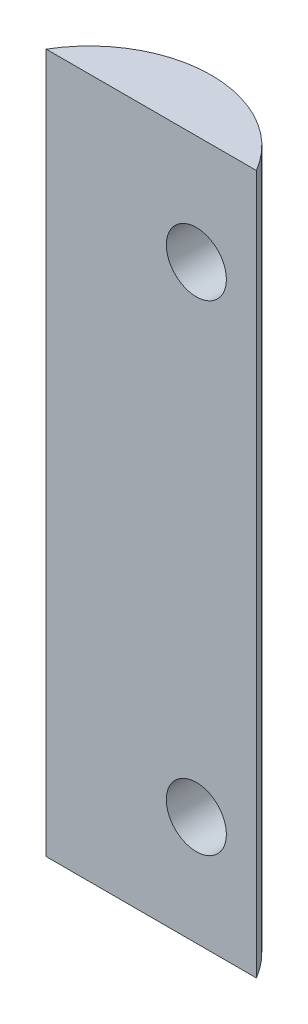
ISO-10303-21;
HEADER;
FILE_DESCRIPTION(('STEP AP214'),'2;1');
FILE_NAME('part.step','',(''),(''),'','','');
FILE_SCHEMA(('AUTOMOTIVE_DESIGN { 1 0 10303 214 1 1 1 1 }'));
ENDSEC;
DATA;
#1=APPLICATION_CONTEXT('core data for automotive mechanical design processes');
#2=APPLICATION_PROTOCOL_DEFINITION('international standard','automotive_design',2000,#1);
#3=PRODUCT_CONTEXT('',#1,'mechanical');
#4=PRODUCT('Part','Part','',(#3));
#5=PRODUCT_RELATED_PRODUCT_CATEGORY('part','',(#4));
#6=PRODUCT_DEFINITION_FORMATION('','',#4);
#7=PRODUCT_DEFINITION_CONTEXT('part definition',#1,'design');
#8=PRODUCT_DEFINITION('design','',#6,#7);
#9=PRODUCT_DEFINITION_SHAPE('','',#8);
#10=(LENGTH_UNIT() NAMED_UNIT(*) SI_UNIT(.MILLI.,.METRE.));
#11=(NAMED_UNIT(*) PLANE_ANGLE_UNIT() SI_UNIT($,.RADIAN.));
#12=(NAMED_UNIT(*) SI_UNIT($,.STERADIAN.) SOLID_ANGLE_UNIT());
#13=UNCERTAINTY_MEASURE_WITH_UNIT(LENGTH_MEASURE(1.E-05),#10,'distance_accuracy_value','');
#14=(GEOMETRIC_REPRESENTATION_CONTEXT(3) GLOBAL_UNCERTAINTY_ASSIGNED_CONTEXT((#13)) GLOBAL_UNIT_ASSIGNED_CONTEXT((#10,
#11,#12)) REPRESENTATION_CONTEXT('',''));
#15=CARTESIAN_POINT('',(0.,0.,0.));
#16=DIRECTION('',(0.,0.,1.));
#17=DIRECTION('',(1.,0.,0.));
#18=AXIS2_PLACEMENT_3D('',#15,#16,#17);
#19=CARTESIAN_POINT('',(0.,67.580002,0.));
#20=DIRECTION('',(0.,0.,-1.));
#21=DIRECTION('',(-1.,0.,0.));
#22=AXIS2_PLACEMENT_3D('',#19,#20,#21);
#23=PLANE('',#22);
#24=CARTESIAN_POINT('',(0.,5.214874,0.));
#25=DIRECTION('',(0.,0.,1.));
#26=DIRECTION('',(1.,0.,0.));
#27=AXIS2_PLACEMENT_3D('',#24,#25,#26);
#28=CIRCLE('',#27,3.175);
#29=CARTESIAN_POINT('',(3.175,5.214874,0.));
#30=VERTEX_POINT('',#29);
#31=EDGE_CURVE('E99',#30,#30,#28,.T.);
#32=ORIENTED_EDGE('',*,*,#31,.F.);
#33=EDGE_LOOP('',(#32));
#34=FACE_BOUND('',#33,.T.);
#35=CARTESIAN_POINT('',(0.,56.015128,0.));
#36=DIRECTION('',(0.,0.,1.));
#37=DIRECTION('',(1.,0.,0.));
#38=AXIS2_PLACEMENT_3D('',#35,#36,#37);
#39=CIRCLE('',#38,3.175);
#40=CARTESIAN_POINT('',(3.175,56.015128,0.));
#41=VERTEX_POINT('',#40);
#42=EDGE_CURVE('E125',#41,#41,#39,.T.);
#43=ORIENTED_EDGE('',*,*,#42,.F.);
#44=EDGE_LOOP('',(#43));
#45=FACE_BOUND('',#44,.T.);
#46=DIRECTION('',(1.,0.,0.));
#47=VECTOR('',#46,1.);
#48=CARTESIAN_POINT('',(0.,-6.35,0.));
#49=LINE('',#48,#47);
#50=CARTESIAN_POINT('',(-15.875,-6.35,0.));
#51=VERTEX_POINT('',#50);
#52=CARTESIAN_POINT('',(6.35,-6.35,0.));
#53=VERTEX_POINT('',#52);
#54=EDGE_CURVE('E74',#51,#53,#49,.T.);
#55=ORIENTED_EDGE('',*,*,#54,.T.);
#56=DIRECTION('',(0.,-1.,0.));
#57=VECTOR('',#56,1.);
#58=CARTESIAN_POINT('',(6.35,67.580002,0.));
#59=LINE('',#58,#57);
#60=CARTESIAN_POINT('',(6.35,67.580002,0.));
#61=VERTEX_POINT('',#60);
#62=EDGE_CURVE('E11',#61,#53,#59,.T.);
#63=ORIENTED_EDGE('',*,*,#62,.F.);
#64=DIRECTION('',(1.,0.,0.));
#65=VECTOR('',#64,1.);
#66=CARTESIAN_POINT('',(0.,67.580002,0.));
#67=LINE('',#66,#65);
#68=CARTESIAN_POINT('',(-15.875,67.580002,0.));
#69=VERTEX_POINT('',#68);
#70=EDGE_CURVE('E86',#69,#61,#67,.T.);
#71=ORIENTED_EDGE('',*,*,#70,.F.);
#72=DIRECTION('',(0.,-1.,0.));
#73=VECTOR('',#72,1.);
#74=CARTESIAN_POINT('',(-15.875,67.580002,0.));
#75=LINE('',#74,#73);
#76=EDGE_CURVE('E57',#69,#51,#75,.T.);
#77=ORIENTED_EDGE('',*,*,#76,.T.);
#78=EDGE_LOOP('',(#55,#63,#71,#77));
#79=FACE_BOUND('',#78,.T.);
#80=ADVANCED_FACE('F43',(#34,#45,#79),#23,.F.);
#81=CARTESIAN_POINT('',(-4.7625,67.580002,6.5484375));
#82=DIRECTION('',(0.,-1.,0.));
#83=DIRECTION('',(0.,0.,-1.));
#84=AXIS2_PLACEMENT_3D('',#81,#82,#83);
#85=CYLINDRICAL_SURFACE('',#84,12.8984375);
#86=CARTESIAN_POINT('',(3.175,5.214874,-3.61845896310054));
#87=CARTESIAN_POINT('',(3.17500029155845,5.2921440701708,-3.61845865162707));
#88=CARTESIAN_POINT('',(3.17217494628216,5.36941074148565,-3.62066641748478));
#89=CARTESIAN_POINT('',(3.16092477458739,5.52331450067409,-3.62943459894672));
#90=CARTESIAN_POINT('',(3.15249779231336,5.59995133464684,-3.63599669036239));
#91=CARTESIAN_POINT('',(3.13018830916982,5.7519438067568,-3.65329567583612));
#92=CARTESIAN_POINT('',(3.11630605119873,5.82729950178142,-3.6640323840174));
#93=CARTESIAN_POINT('',(3.08331514599964,5.97620139469253,-3.68939941002583));
#94=CARTESIAN_POINT('',(3.06420415714726,6.04974676572433,-3.7040314722612));
#95=CARTESIAN_POINT('',(2.99970218374855,6.26601541740172,-3.75305885545857));
#96=CARTESIAN_POINT('',(2.9469791643884,6.40544484829262,-3.79271518717727));
#97=CARTESIAN_POINT('',(2.82442881282292,6.6725761756134,-3.88295570262731));
#98=CARTESIAN_POINT('',(2.7545956444484,6.8002740500019,-3.93354361435852));
#99=CARTESIAN_POINT('',(2.59237992999635,7.05475583747086,-4.04808197326832));
#100=CARTESIAN_POINT('',(2.49844020076017,7.18016959548624,-4.11286301294358));
#101=CARTESIAN_POINT('',(2.29521823437965,7.41411185332294,-4.24847208060614));
#102=CARTESIAN_POINT('',(2.1859279353107,7.52263141697701,-4.31930327835023));
#103=CARTESIAN_POINT('',(1.93138065942859,7.74148885573973,-4.47826997752822));
#104=CARTESIAN_POINT('',(1.78326915895043,7.84803541080755,-4.56708150040062));
#105=CARTESIAN_POINT('',(1.47119073823516,8.0343258022771,-4.74506321575416));
#106=CARTESIAN_POINT('',(1.30721296467085,8.11405112230921,-4.83423361318672));
#107=CARTESIAN_POINT('',(0.951295750286282,8.25049948091979,-5.01726678919524));
#108=CARTESIAN_POINT('',(0.758165872020518,8.30456755734286,-5.11084798187377));
#109=CARTESIAN_POINT('',(0.461109140868174,8.3578287940601,-5.24544016431096));
#110=CARTESIAN_POINT('',(0.360810762795934,8.37094197166944,-5.28936166307805));
#111=CARTESIAN_POINT('',(0.158465095092231,8.3875383343744,-5.37489298816599));
#112=CARTESIAN_POINT('',(0.0564187624306949,8.39102662939017,-5.41650402962234));
#113=CARTESIAN_POINT('',(-0.143697886170491,8.38812336953803,-5.49512385220796));
#114=CARTESIAN_POINT('',(-0.241726201201153,8.38219426974641,-5.53225742551915));
#115=CARTESIAN_POINT('',(-0.437737274208508,8.36109706115511,-5.60380473376646));
#116=CARTESIAN_POINT('',(-0.535720030560133,8.34593355504163,-5.63821981402773));
#117=CARTESIAN_POINT('',(-0.730737999312872,8.30624034514854,-5.70412048241188));
#118=CARTESIAN_POINT('',(-0.827773509636956,8.28171369038607,-5.73560702003919));
#119=CARTESIAN_POINT('',(-1.0199433424238,8.22326619286368,-5.79551187375221));
#120=CARTESIAN_POINT('',(-1.11507785488985,8.18934629403782,-5.82393049773622));
#121=CARTESIAN_POINT('',(-1.2932752926261,8.11598103332187,-5.8750043601246));
#122=CARTESIAN_POINT('',(-1.3766104012884,8.07739764869482,-5.89795138845065));
#123=CARTESIAN_POINT('',(-1.54016736468118,7.99282085164255,-5.94129517591087));
#124=CARTESIAN_POINT('',(-1.62038811983224,7.94682485105793,-5.96169103985667));
#125=CARTESIAN_POINT('',(-1.77687845129753,7.84772322504184,-5.99995831517187));
#126=CARTESIAN_POINT('',(-1.85315059963564,7.79462231048822,-6.01783138326944));
#127=CARTESIAN_POINT('',(-2.00107961503945,7.68165018306383,-6.05116594048672));
#128=CARTESIAN_POINT('',(-2.07273482176762,7.62177655569496,-6.06662656485746));
#129=CARTESIAN_POINT('',(-2.27159400513747,7.4400359662489,-6.10788997306092));
#130=CARTESIAN_POINT('',(-2.39212476680084,7.31002180788773,-6.13080529239027));
#131=CARTESIAN_POINT('',(-2.61018571307227,7.03116964108646,-6.169643174857));
#132=CARTESIAN_POINT('',(-2.70771789937332,6.88233327258079,-6.18556634666366));
#133=CARTESIAN_POINT('',(-2.87574692225581,6.57188578168915,-6.21153952657473));
#134=CARTESIAN_POINT('',(-2.94654490001103,6.41044330312018,-6.22165566629257));
#135=CARTESIAN_POINT('',(-3.0605142619,6.07788193021859,-6.23734638899209));
#136=CARTESIAN_POINT('',(-3.10368515705651,5.90676286467647,-6.24292089159091));
#137=CARTESIAN_POINT('',(-3.16124439987613,5.55891862498811,-6.25025492095319));
#138=CARTESIAN_POINT('',(-3.17550914635837,5.38217264518706,-6.25199806771476));
#139=CARTESIAN_POINT('',(-3.17446299904402,5.02876704055326,-6.25186828729976));
#140=CARTESIAN_POINT('',(-3.15915145950071,4.85210741769018,-6.24999528117078));
#141=CARTESIAN_POINT('',(-3.09932960260839,4.50343623712956,-6.24235818988753));
#142=CARTESIAN_POINT('',(-3.05474731888307,4.33143722633677,-6.2365845133512));
#143=CARTESIAN_POINT('',(-2.93765612238383,3.99745356832839,-6.22039579970276));
#144=CARTESIAN_POINT('',(-2.86514769772941,3.83546874613276,-6.20998084371483));
#145=CARTESIAN_POINT('',(-2.69464055060396,3.52650240415692,-6.18345321124056));
#146=CARTESIAN_POINT('',(-2.5966988674882,3.37948832360842,-6.16735325583885));
#147=CARTESIAN_POINT('',(-2.37838771763343,3.10424732575389,-6.12823219486352));
#148=CARTESIAN_POINT('',(-2.25802014982716,2.97601881940282,-6.10521167519394));
#149=CARTESIAN_POINT('',(-1.99941744380487,2.74238905683983,-6.05126056417378));
#150=CARTESIAN_POINT('',(-1.86126578240751,2.63688694835687,-6.02036630640185));
#151=CARTESIAN_POINT('',(-1.57125841800309,2.45055091325239,-5.94987856073665));
#152=CARTESIAN_POINT('',(-1.41940302371465,2.36971643109656,-5.910285268787));
#153=CARTESIAN_POINT('',(-1.10550994515041,2.23359896676959,-5.82180553620153));
#154=CARTESIAN_POINT('',(-0.943393885269859,2.17854900856806,-5.77283977329668));
#155=CARTESIAN_POINT('',(-0.615164246925479,2.09543774189246,-5.66627030457636));
#156=CARTESIAN_POINT('',(-0.449049882986559,2.06738178154045,-5.60866488966228));
#157=CARTESIAN_POINT('',(-0.109458564307642,2.03697050219822,-5.4829048252979));
#158=CARTESIAN_POINT('',(0.0639941384272899,2.03589649524786,-5.41437955571862));
#159=CARTESIAN_POINT('',(0.406009243876505,2.06126934219087,-5.27064333297133));
#160=CARTESIAN_POINT('',(0.574570106965336,2.08772476599904,-5.19543030457111));
#161=CARTESIAN_POINT('',(0.917794182473879,2.16986234489325,-5.03357505540364));
#162=CARTESIAN_POINT('',(1.09169140536315,2.22790914060321,-4.9465093365185));
#163=CARTESIAN_POINT('',(1.42611850843886,2.37233345112945,-4.76997774068824));
#164=CARTESIAN_POINT('',(1.58663659159165,2.45873564371017,-4.6805098356137));
#165=CARTESIAN_POINT('',(1.90346369918748,2.66611644785961,-4.49560605638029));
#166=CARTESIAN_POINT('',(2.05837804151773,2.78932926584323,-4.40027394193835));
#167=CARTESIAN_POINT('',(2.34470378385709,3.06490012216338,-4.21660928889522));
#168=CARTESIAN_POINT('',(2.4761352154676,3.21723308831216,-4.12827082068667));
#169=CARTESIAN_POINT('',(2.68414340342812,3.51169277473337,-3.98386963689914));
#170=CARTESIAN_POINT('',(2.76641145809164,3.64844162029326,-3.92501222527243));
#171=CARTESIAN_POINT('',(2.91081345377315,3.93672951738565,-3.81968463242392));
#172=CARTESIAN_POINT('',(2.97296687081609,4.08825407615837,-3.7732024766262));
#173=CARTESIAN_POINT('',(3.04804529007878,4.32234828249747,-3.71635786454595));
#174=CARTESIAN_POINT('',(3.06990380991777,4.40063194155513,-3.69966984511347));
#175=CARTESIAN_POINT('',(3.10767219938745,4.55940361580136,-3.67069401211237));
#176=CARTESIAN_POINT('',(3.12358517824933,4.63989045513003,-3.65840389879346));
#177=CARTESIAN_POINT('',(3.14916600743888,4.8023897928754,-3.63858824894905));
#178=CARTESIAN_POINT('',(3.15883683517379,4.88440154469905,-3.63106044091347));
#179=CARTESIAN_POINT('',(3.17175344510506,5.04923487144051,-3.62099614366395));
#180=CARTESIAN_POINT('',(3.17499968750935,5.13205638792587,-3.61845929693599));
#181=CARTESIAN_POINT('',(3.175,5.214874,-3.61845896310054));
#182=B_SPLINE_CURVE_WITH_KNOTS('',3,(#86,#87,#88,#89,#90,#91,#92,#93,#94,#95,#96,#97,#98,#99,
#100,#101,#102,#103,#104,#105,#106,#107,#108,#109,#110,#111,#112,#113,#114,#115,#116,#117,#118,
#119,#120,#121,#122,#123,#124,#125,#126,#127,#128,#129,#130,#131,#132,#133,#134,#135,#136,#137,
#138,#139,#140,#141,#142,#143,#144,#145,#146,#147,#148,#149,#150,#151,#152,#153,#154,#155,#156,
#157,#158,#159,#160,#161,#162,#163,#164,#165,#166,#167,#168,#169,#170,#171,#172,#173,#174,#175,
#176,#177,#178,#179,#180,#181),.UNSPECIFIED.,.T.,.F.,(4,2,2,2,2,2,2,2,2,2,2,2,2,2,2,2,2,2,2,2,2,
2,2,2,2,2,2,2,2,2,2,2,2,2,2,2,2,2,2,2,2,2,2,2,2,2,2,4),(0.,0.23172170254418,0.463532637571483,
0.695333252289378,0.927237846532125,1.38780878735857,1.84853704540815,2.35536912389958,
2.86246838644239,3.46869500436955,4.07533928356596,4.73558707584401,5.06604470425751,
5.39632685652519,5.7108848849167,6.02528625696998,6.33958533452529,6.65385283938742,
6.9374587227516,7.22116384420985,7.5046817800491,7.78830111158175,8.32177184268103,
8.85519612572542,9.38241858057933,9.90965036659036,10.439131851098,10.9686248960431,
11.4994246762914,12.0302151791403,12.5598254035064,13.0893908029968,13.6165554088367,
14.1437081416398,14.6755371559432,15.2074715159301,15.7646208143044,16.3219436052166,
16.9282554412655,17.5350963574279,18.1911032211856,18.8465477923047,19.3549401883814,
19.8628388497613,20.1114634329343,20.3599578148524,20.6083335811239,20.8566915550204),.UNSPECIFIED.);
#183=CARTESIAN_POINT('',(3.175,5.214874,-3.61845896310054));
#184=VERTEX_POINT('',#183);
#185=EDGE_CURVE('E46',#184,#184,#182,.T.);
#186=ORIENTED_EDGE('',*,*,#185,.T.);
#187=EDGE_LOOP('',(#186));
#188=FACE_BOUND('',#187,.T.);
#189=CARTESIAN_POINT('',(3.175,56.015128,-3.61845896310054));
#190=CARTESIAN_POINT('',(3.17500029155845,56.0923980701708,-3.61845865162707));
#191=CARTESIAN_POINT('',(3.17217494628215,56.1696647414856,-3.62066641748478));
#192=CARTESIAN_POINT('',(3.16092477458739,56.3235685006741,-3.62943459894672));
#193=CARTESIAN_POINT('',(3.15249779231336,56.4002053346468,-3.6359966903624));
#194=CARTESIAN_POINT('',(3.13018830916982,56.5521978067568,-3.65329567583612));
#195=CARTESIAN_POINT('',(3.11630605119873,56.6275535017814,-3.6640323840174));
#196=CARTESIAN_POINT('',(3.08331514599964,56.7764553946925,-3.68939941002583));
#197=CARTESIAN_POINT('',(3.06420415714726,56.8500007657243,-3.7040314722612));
#198=CARTESIAN_POINT('',(2.99970218374854,57.0662694174017,-3.75305885545857));
#199=CARTESIAN_POINT('',(2.9469791643884,57.2056988482926,-3.79271518717727));
#200=CARTESIAN_POINT('',(2.82442881282292,57.4728301756134,-3.88295570262731));
#201=CARTESIAN_POINT('',(2.7545956444484,57.6005280500019,-3.93354361435852));
#202=CARTESIAN_POINT('',(2.59237992999635,57.8550098374709,-4.04808197326832));
#203=CARTESIAN_POINT('',(2.49844020076017,57.9804235954862,-4.11286301294359));
#204=CARTESIAN_POINT('',(2.29521823437965,58.2143658533229,-4.24847208060614));
#205=CARTESIAN_POINT('',(2.1859279353107,58.322885416977,-4.31930327835022));
#206=CARTESIAN_POINT('',(1.93138065942859,58.5417428557397,-4.47826997752821));
#207=CARTESIAN_POINT('',(1.78326915895043,58.6482894108075,-4.56708150040062));
#208=CARTESIAN_POINT('',(1.47119073823516,58.8345798022771,-4.74506321575416));
#209=CARTESIAN_POINT('',(1.30721296467085,58.9143051223092,-4.83423361318672));
#210=CARTESIAN_POINT('',(0.951295750286285,59.0507534809198,-5.01726678919524));
#211=CARTESIAN_POINT('',(0.758165872020521,59.1048215573429,-5.11084798187377));
#212=CARTESIAN_POINT('',(0.461109140868176,59.1580827940601,-5.24544016431096));
#213=CARTESIAN_POINT('',(0.360810762795936,59.1711959716694,-5.28936166307804));
#214=CARTESIAN_POINT('',(0.158465095092232,59.1877923343744,-5.37489298816599));
#215=CARTESIAN_POINT('',(0.0564187624306969,59.1912806293902,-5.41650402962234));
#216=CARTESIAN_POINT('',(-0.143697886170489,59.188377369538,-5.49512385220796));
#217=CARTESIAN_POINT('',(-0.241726201201151,59.1824482697464,-5.53225742551915));
#218=CARTESIAN_POINT('',(-0.437737274208507,59.1613510611551,-5.60380473376646));
#219=CARTESIAN_POINT('',(-0.535720030560132,59.1461875550416,-5.63821981402773));
#220=CARTESIAN_POINT('',(-0.730737999312872,59.1064943451485,-5.70412048241188));
#221=CARTESIAN_POINT('',(-0.827773509636956,59.0819676903861,-5.7356070200392));
#222=CARTESIAN_POINT('',(-1.0199433424238,59.0235201928637,-5.79551187375221));
#223=CARTESIAN_POINT('',(-1.11507785488986,58.9896002940378,-5.82393049773622));
#224=CARTESIAN_POINT('',(-1.2932752926261,58.9162350333219,-5.8750043601246));
#225=CARTESIAN_POINT('',(-1.3766104012884,58.8776516486948,-5.89795138845065));
#226=CARTESIAN_POINT('',(-1.54016736468118,58.7930748516425,-5.94129517591087));
#227=CARTESIAN_POINT('',(-1.62038811983224,58.7470788510579,-5.96169103985667));
#228=CARTESIAN_POINT('',(-1.77687845129753,58.6479772250418,-5.99995831517187));
#229=CARTESIAN_POINT('',(-1.85315059963564,58.5948763104882,-6.01783138326944));
#230=CARTESIAN_POINT('',(-2.00107961503945,58.4819041830638,-6.05116594048672));
#231=CARTESIAN_POINT('',(-2.07273482176762,58.422030555695,-6.06662656485746));
#232=CARTESIAN_POINT('',(-2.27159400513747,58.2402899662489,-6.10788997306092));
#233=CARTESIAN_POINT('',(-2.39212476680084,58.1102758078877,-6.13080529239027));
#234=CARTESIAN_POINT('',(-2.61018571307227,57.8314236410865,-6.169643174857));
#235=CARTESIAN_POINT('',(-2.70771789937332,57.6825872725808,-6.18556634666366));
#236=CARTESIAN_POINT('',(-2.87574692225581,57.3721397816891,-6.21153952657473));
#237=CARTESIAN_POINT('',(-2.94654490001103,57.2106973031202,-6.22165566629257));
#238=CARTESIAN_POINT('',(-3.0605142619,56.8781359302186,-6.23734638899209));
#239=CARTESIAN_POINT('',(-3.10368515705651,56.7070168646765,-6.24292089159091));
#240=CARTESIAN_POINT('',(-3.16124439987612,56.3591726249881,-6.25025492095319));
#241=CARTESIAN_POINT('',(-3.17550914635836,56.1824266451871,-6.25199806771476));
#242=CARTESIAN_POINT('',(-3.17446299904402,55.8290210405533,-6.25186828729976));
#243=CARTESIAN_POINT('',(-3.15915145950071,55.6523614176902,-6.24999528117078));
#244=CARTESIAN_POINT('',(-3.09932960260839,55.3036902371296,-6.24235818988753));
#245=CARTESIAN_POINT('',(-3.05474731888307,55.1316912263368,-6.2365845133512));
#246=CARTESIAN_POINT('',(-2.93765612238383,54.7977075683284,-6.22039579970276));
#247=CARTESIAN_POINT('',(-2.86514769772941,54.6357227461328,-6.20998084371483));
#248=CARTESIAN_POINT('',(-2.69464055060396,54.3267564041569,-6.18345321124056));
#249=CARTESIAN_POINT('',(-2.5966988674882,54.1797423236084,-6.16735325583885));
#250=CARTESIAN_POINT('',(-2.37838771763344,53.9045013257539,-6.12823219486352));
#251=CARTESIAN_POINT('',(-2.25802014982716,53.7762728194028,-6.10521167519394));
#252=CARTESIAN_POINT('',(-1.99941744380487,53.5426430568398,-6.05126056417378));
#253=CARTESIAN_POINT('',(-1.86126578240752,53.4371409483569,-6.02036630640185));
#254=CARTESIAN_POINT('',(-1.5712584180031,53.2508049132524,-5.94987856073665));
#255=CARTESIAN_POINT('',(-1.41940302371466,53.1699704310966,-5.910285268787));
#256=CARTESIAN_POINT('',(-1.10550994515041,53.0338529667696,-5.82180553620153));
#257=CARTESIAN_POINT('',(-0.943393885269859,52.9788030085681,-5.77283977329668));
#258=CARTESIAN_POINT('',(-0.615164246925479,52.8956917418925,-5.66627030457636));
#259=CARTESIAN_POINT('',(-0.449049882986561,52.8676357815404,-5.60866488966228));
#260=CARTESIAN_POINT('',(-0.109458564307644,52.8372245021982,-5.4829048252979));
#261=CARTESIAN_POINT('',(0.0639941384272872,52.8361504952479,-5.41437955571862));
#262=CARTESIAN_POINT('',(0.406009243876502,52.8615233421909,-5.27064333297133));
#263=CARTESIAN_POINT('',(0.574570106965332,52.887978765999,-5.19543030457111));
#264=CARTESIAN_POINT('',(0.917794182473877,52.9701163448932,-5.03357505540364));
#265=CARTESIAN_POINT('',(1.09169140536315,53.0281631406032,-4.9465093365185));
#266=CARTESIAN_POINT('',(1.42611850843886,53.1725874511294,-4.76997774068824));
#267=CARTESIAN_POINT('',(1.58663659159165,53.2589896437102,-4.68050983561371));
#268=CARTESIAN_POINT('',(1.90346369918747,53.4663704478596,-4.49560605638029));
#269=CARTESIAN_POINT('',(2.05837804151772,53.5895832658432,-4.40027394193835));
#270=CARTESIAN_POINT('',(2.34470378385709,53.8651541221634,-4.21660928889522));
#271=CARTESIAN_POINT('',(2.4761352154676,54.0174870883122,-4.12827082068667));
#272=CARTESIAN_POINT('',(2.68414340342812,54.3119467747334,-3.98386963689914));
#273=CARTESIAN_POINT('',(2.76641145809164,54.4486956202933,-3.92501222527243));
#274=CARTESIAN_POINT('',(2.91081345377314,54.7369835173857,-3.81968463242392));
#275=CARTESIAN_POINT('',(2.97296687081609,54.8885080761584,-3.7732024766262));
#276=CARTESIAN_POINT('',(3.04804529007878,55.1226022824975,-3.71635786454596));
#277=CARTESIAN_POINT('',(3.06990380991777,55.2008859415551,-3.69966984511347));
#278=CARTESIAN_POINT('',(3.10767219938744,55.3596576158014,-3.67069401211238));
#279=CARTESIAN_POINT('',(3.12358517824933,55.44014445513,-3.65840389879346));
#280=CARTESIAN_POINT('',(3.14916600743888,55.6026437928754,-3.63858824894905));
#281=CARTESIAN_POINT('',(3.15883683517379,55.684655544699,-3.63106044091347));
#282=CARTESIAN_POINT('',(3.17175344510506,55.8494888714405,-3.62099614366395));
#283=CARTESIAN_POINT('',(3.17499968750934,55.9323103879259,-3.61845929693599));
#284=CARTESIAN_POINT('',(3.175,56.015128,-3.61845896310054));
#285=B_SPLINE_CURVE_WITH_KNOTS('',3,(#189,#190,#191,#192,#193,#194,#195,#196,#197,#198,#199,
#200,#201,#202,#203,#204,#205,#206,#207,#208,#209,#210,#211,#212,#213,#214,#215,#216,#217,#218,
#219,#220,#221,#222,#223,#224,#225,#226,#227,#228,#229,#230,#231,#232,#233,#234,#235,#236,#237,
#238,#239,#240,#241,#242,#243,#244,#245,#246,#247,#248,#249,#250,#251,#252,#253,#254,#255,#256,
#257,#258,#259,#260,#261,#262,#263,#264,#265,#266,#267,#268,#269,#270,#271,#272,#273,#274,#275,
#276,#277,#278,#279,#280,#281,#282,#283,#284),.UNSPECIFIED.,.T.,.F.,(4,2,2,2,2,2,2,2,2,2,2,2,2,
2,2,2,2,2,2,2,2,2,2,2,2,2,2,2,2,2,2,2,2,2,2,2,2,2,2,2,2,2,2,2,2,2,2,4),(0.,0.23172170254418,
0.463532637571486,0.695333252289375,0.927237846532124,1.38780878735857,1.84853704540815,
2.35536912389958,2.86246838644238,3.46869500436955,4.07533928356595,4.735587075844,
5.06604470425751,5.39632685652519,5.7108848849167,6.02528625696998,6.33958533452529,
6.65385283938742,6.9374587227516,7.22116384420985,7.50468178004909,7.78830111158175,
8.32177184268103,8.85519612572541,9.38241858057931,9.90965036659035,10.439131851098,
10.9686248960431,11.4994246762914,12.0302151791403,12.5598254035064,13.0893908029968,
13.6165554088367,14.1437081416398,14.6755371559432,15.2074715159301,15.7646208143044,
16.3219436052166,16.9282554412655,17.5350963574279,18.1911032211856,18.8465477923047,
19.3549401883814,19.8628388497613,20.1114634329343,20.3599578148524,20.6083335811239,
20.8566915550204),.UNSPECIFIED.);
#286=CARTESIAN_POINT('',(3.175,56.015128,-3.61845896310054));
#287=VERTEX_POINT('',#286);
#288=EDGE_CURVE('E92',#287,#287,#285,.T.);
#289=ORIENTED_EDGE('',*,*,#288,.T.);
#290=EDGE_LOOP('',(#289));
#291=FACE_BOUND('',#290,.T.);
#292=CARTESIAN_POINT('',(-4.7625,-6.35,6.5484375));
#293=DIRECTION('',(0.,1.,0.));
#294=DIRECTION('',(0.,0.,-1.));
#295=AXIS2_PLACEMENT_3D('',#292,#293,#294);
#296=CIRCLE('',#295,12.8984375);
#297=EDGE_CURVE('E79',#53,#51,#296,.T.);
#298=ORIENTED_EDGE('',*,*,#297,.T.);
#299=ORIENTED_EDGE('',*,*,#76,.F.);
#300=CARTESIAN_POINT('',(-4.7625,67.580002,6.5484375));
#301=DIRECTION('',(0.,1.,0.));
#302=DIRECTION('',(0.,0.,-1.));
#303=AXIS2_PLACEMENT_3D('',#300,#301,#302);
#304=CIRCLE('',#303,12.8984375);
#305=EDGE_CURVE('E65',#61,#69,#304,.T.);
#306=ORIENTED_EDGE('',*,*,#305,.F.);
#307=ORIENTED_EDGE('',*,*,#62,.T.);
#308=EDGE_LOOP('',(#298,#299,#306,#307));
#309=FACE_BOUND('',#308,.T.);
#310=ADVANCED_FACE('F83',(#188,#291,#309),#85,.T.);
#311=CARTESIAN_POINT('',(-4.7625,67.580002,6.5484375));
#312=DIRECTION('',(0.,-1.,0.));
#313=DIRECTION('',(0.,0.,-1.));
#314=AXIS2_PLACEMENT_3D('',#311,#312,#313);
#315=PLANE('',#314);
#316=ORIENTED_EDGE('',*,*,#70,.T.);
#317=ORIENTED_EDGE('',*,*,#305,.T.);
#318=EDGE_LOOP('',(#316,#317));
#319=FACE_BOUND('',#318,.T.);
#320=ADVANCED_FACE('F109',(#319),#315,.F.);
#321=CARTESIAN_POINT('',(-4.7625,-6.35,6.5484375));
#322=DIRECTION('',(0.,-1.,0.));
#323=DIRECTION('',(0.,0.,-1.));
#324=AXIS2_PLACEMENT_3D('',#321,#322,#323);
#325=PLANE('',#324);
#326=ORIENTED_EDGE('',*,*,#54,.F.);
#327=ORIENTED_EDGE('',*,*,#297,.F.);
#328=EDGE_LOOP('',(#326,#327));
#329=FACE_BOUND('',#328,.T.);
#330=ADVANCED_FACE('F78',(#329),#325,.T.);
#331=CARTESIAN_POINT('',(0.,56.015128,-6.35));
#332=DIRECTION('',(0.,0.,1.));
#333=DIRECTION('',(1.,0.,0.));
#334=AXIS2_PLACEMENT_3D('',#331,#332,#333);
#335=CYLINDRICAL_SURFACE('',#334,3.175);
#336=ORIENTED_EDGE('',*,*,#42,.T.);
#337=EDGE_LOOP('',(#336));
#338=FACE_BOUND('',#337,.T.);
#339=ORIENTED_EDGE('',*,*,#288,.F.);
#340=EDGE_LOOP('',(#339));
#341=FACE_BOUND('',#340,.T.);
#342=ADVANCED_FACE('F102',(#338,#341),#335,.F.);
#343=CARTESIAN_POINT('',(0.,5.214874,-6.35));
#344=DIRECTION('',(0.,0.,1.));
#345=DIRECTION('',(1.,0.,0.));
#346=AXIS2_PLACEMENT_3D('',#343,#344,#345);
#347=CYLINDRICAL_SURFACE('',#346,3.175);
#348=ORIENTED_EDGE('',*,*,#31,.T.);
#349=EDGE_LOOP('',(#348));
#350=FACE_BOUND('',#349,.T.);
#351=ORIENTED_EDGE('',*,*,#185,.F.);
#352=EDGE_LOOP('',(#351));
#353=FACE_BOUND('',#352,.T.);
#354=ADVANCED_FACE('F106',(#350,#353),#347,.F.);
#355=CLOSED_SHELL('',(#80,#310,#320,#330,#342,#354));
#356=MANIFOLD_SOLID_BREP('B2',#355);
#357=ADVANCED_BREP_SHAPE_REPRESENTATION('',(#18,#356),#14);
#358=SHAPE_DEFINITION_REPRESENTATION(#9,#357);
ENDSEC;
END-ISO-10303-21;
